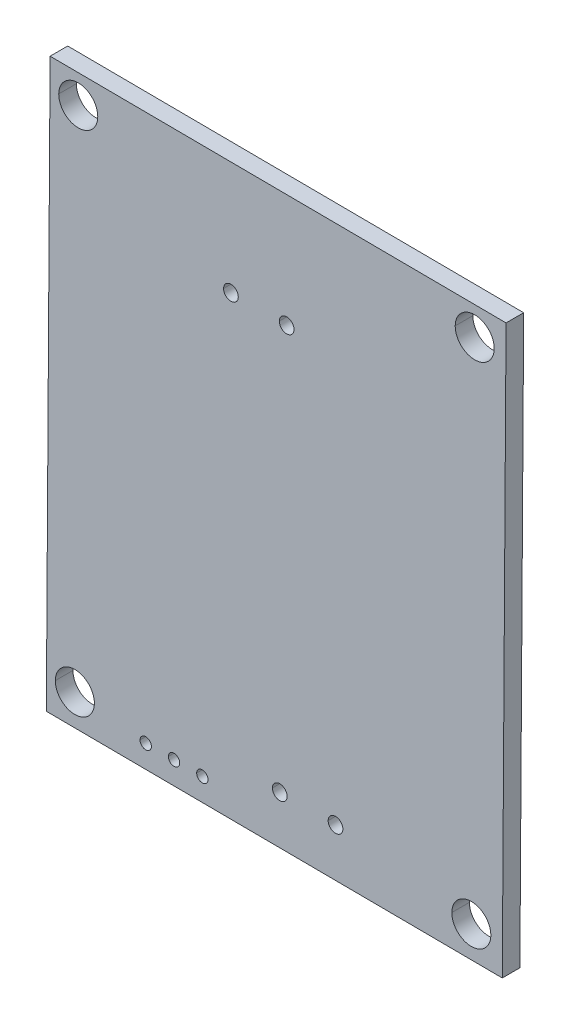
ISO-10303-21;
HEADER;
FILE_DESCRIPTION(('STEP AP214'),'2;1');
FILE_NAME('part.step','',(''),(''),'','','');
FILE_SCHEMA(('AUTOMOTIVE_DESIGN { 1 0 10303 214 1 1 1 1 }'));
ENDSEC;
DATA;
#1=APPLICATION_CONTEXT('core data for automotive mechanical design processes');
#2=APPLICATION_PROTOCOL_DEFINITION('international standard','automotive_design',2000,#1);
#3=PRODUCT_CONTEXT('',#1,'mechanical');
#4=PRODUCT('Part','Part','',(#3));
#5=PRODUCT_RELATED_PRODUCT_CATEGORY('part','',(#4));
#6=PRODUCT_DEFINITION_FORMATION('','',#4);
#7=PRODUCT_DEFINITION_CONTEXT('part definition',#1,'design');
#8=PRODUCT_DEFINITION('design','',#6,#7);
#9=PRODUCT_DEFINITION_SHAPE('','',#8);
#10=(LENGTH_UNIT() NAMED_UNIT(*) SI_UNIT(.MILLI.,.METRE.));
#11=(NAMED_UNIT(*) PLANE_ANGLE_UNIT() SI_UNIT($,.RADIAN.));
#12=(NAMED_UNIT(*) SI_UNIT($,.STERADIAN.) SOLID_ANGLE_UNIT());
#13=UNCERTAINTY_MEASURE_WITH_UNIT(LENGTH_MEASURE(1.E-05),#10,'distance_accuracy_value','');
#14=(GEOMETRIC_REPRESENTATION_CONTEXT(3) GLOBAL_UNCERTAINTY_ASSIGNED_CONTEXT((#13)) GLOBAL_UNIT_ASSIGNED_CONTEXT((#10,
#11,#12)) REPRESENTATION_CONTEXT('',''));
#15=CARTESIAN_POINT('',(0.,0.,0.));
#16=DIRECTION('',(0.,0.,1.));
#17=DIRECTION('',(1.,0.,0.));
#18=AXIS2_PLACEMENT_3D('',#15,#16,#17);
#19=CARTESIAN_POINT('',(220.01480723588,82.6072608987115,139.791582908599));
#20=DIRECTION('',(0.,0.,1.));
#21=DIRECTION('',(0.999978016708569,-0.00663069374924009,0.));
#22=AXIS2_PLACEMENT_3D('',#19,#20,#21);
#23=CYLINDRICAL_SURFACE('',#22,1.75);
#24=CARTESIAN_POINT('',(220.01480723588,82.6072608987115,140.581582908599));
#25=DIRECTION('',(0.,0.,1.));
#26=DIRECTION('',(0.999978016708569,-0.00663069374924009,0.));
#27=AXIS2_PLACEMENT_3D('',#24,#25,#26);
#28=CIRCLE('',#27,1.75);
#29=CARTESIAN_POINT('',(218.26484570664,82.6188646127726,140.581582908599));
#30=VERTEX_POINT('',#29);
#31=CARTESIAN_POINT('',(221.764768765119,82.5956571846503,140.581582908599));
#32=VERTEX_POINT('',#31);
#33=EDGE_CURVE('E67',#30,#32,#28,.T.);
#34=ORIENTED_EDGE('',*,*,#33,.F.);
#35=DIRECTION('',(0.,0.,1.));
#36=VECTOR('',#35,1.);
#37=CARTESIAN_POINT('',(218.26484570664,82.6188646127726,139.791582908599));
#38=LINE('',#37,#36);
#39=CARTESIAN_POINT('',(218.26484570664,82.6188646127726,142.161582908599));
#40=VERTEX_POINT('',#39);
#41=EDGE_CURVE('E11',#30,#40,#38,.T.);
#42=ORIENTED_EDGE('',*,*,#41,.T.);
#43=CARTESIAN_POINT('',(220.01480723588,82.6072608987115,142.161582908599));
#44=DIRECTION('',(0.,0.,1.));
#45=DIRECTION('',(0.999978016708569,-0.00663069374924009,0.));
#46=AXIS2_PLACEMENT_3D('',#43,#44,#45);
#47=CIRCLE('',#46,1.75);
#48=CARTESIAN_POINT('',(221.764768765119,82.5956571846503,142.161582908599));
#49=VERTEX_POINT('',#48);
#50=EDGE_CURVE('E55',#40,#49,#47,.T.);
#51=ORIENTED_EDGE('',*,*,#50,.T.);
#52=DIRECTION('',(0.,0.,1.));
#53=VECTOR('',#52,1.);
#54=CARTESIAN_POINT('',(221.764768765119,82.5956571846503,139.791582908599));
#55=LINE('',#54,#53);
#56=EDGE_CURVE('E366',#32,#49,#55,.T.);
#57=ORIENTED_EDGE('',*,*,#56,.F.);
#58=EDGE_LOOP('',(#34,#42,#51,#57));
#59=FACE_BOUND('',#58,.T.);
#60=ADVANCED_FACE('F44',(#59),#23,.F.);
#61=CARTESIAN_POINT('',(207.833180433443,84.212068814366,139.791582908599));
#62=DIRECTION('',(0.,0.,1.));
#63=DIRECTION('',(0.999978016708569,-0.0066306937492422,0.));
#64=AXIS2_PLACEMENT_3D('',#61,#62,#63);
#65=CYLINDRICAL_SURFACE('',#64,0.660000000000009);
#66=CARTESIAN_POINT('',(207.833180433443,84.212068814366,140.581582908599));
#67=DIRECTION('',(0.,0.,1.));
#68=DIRECTION('',(0.999978016708569,-0.0066306937492422,0.));
#69=AXIS2_PLACEMENT_3D('',#66,#67,#68);
#70=CIRCLE('',#69,0.660000000000009);
#71=CARTESIAN_POINT('',(207.173194942415,84.2164450722405,140.581582908599));
#72=VERTEX_POINT('',#71);
#73=CARTESIAN_POINT('',(208.49316592447,84.2076925564915,140.581582908599));
#74=VERTEX_POINT('',#73);
#75=EDGE_CURVE('E239',#72,#74,#70,.T.);
#76=ORIENTED_EDGE('',*,*,#75,.F.);
#77=DIRECTION('',(0.,0.,1.));
#78=VECTOR('',#77,1.);
#79=CARTESIAN_POINT('',(207.173194942415,84.2164450722405,139.791582908599));
#80=LINE('',#79,#78);
#81=CARTESIAN_POINT('',(207.173194942415,84.2164450722405,142.161582908599));
#82=VERTEX_POINT('',#81);
#83=EDGE_CURVE('E240',#72,#82,#80,.T.);
#84=ORIENTED_EDGE('',*,*,#83,.T.);
#85=CARTESIAN_POINT('',(207.833180433443,84.212068814366,142.161582908599));
#86=DIRECTION('',(0.,0.,1.));
#87=DIRECTION('',(0.999978016708569,-0.0066306937492422,0.));
#88=AXIS2_PLACEMENT_3D('',#85,#86,#87);
#89=CIRCLE('',#88,0.660000000000009);
#90=CARTESIAN_POINT('',(208.49316592447,84.2076925564915,142.161582908599));
#91=VERTEX_POINT('',#90);
#92=EDGE_CURVE('E244',#82,#91,#89,.T.);
#93=ORIENTED_EDGE('',*,*,#92,.T.);
#94=DIRECTION('',(0.,0.,1.));
#95=VECTOR('',#94,1.);
#96=CARTESIAN_POINT('',(208.49316592447,84.2076925564915,139.791582908599));
#97=LINE('',#96,#95);
#98=EDGE_CURVE('E437',#74,#91,#97,.T.);
#99=ORIENTED_EDGE('',*,*,#98,.F.);
#100=EDGE_LOOP('',(#76,#84,#93,#99));
#101=FACE_BOUND('',#100,.T.);
#102=ADVANCED_FACE('F624',(#101),#65,.F.);
#103=CARTESIAN_POINT('',(202.833290349899,84.2452222831122,139.791582908599));
#104=DIRECTION('',(0.,0.,1.));
#105=DIRECTION('',(0.999978016708569,-0.0066306937492422,0.));
#106=AXIS2_PLACEMENT_3D('',#103,#104,#105);
#107=CYLINDRICAL_SURFACE('',#106,0.660000000000009);
#108=CARTESIAN_POINT('',(202.833290349899,84.2452222831122,140.581582908599));
#109=DIRECTION('',(0.,0.,1.));
#110=DIRECTION('',(0.999978016708569,-0.0066306937492422,0.));
#111=AXIS2_PLACEMENT_3D('',#108,#109,#110);
#112=CIRCLE('',#111,0.660000000000009);
#113=CARTESIAN_POINT('',(202.173304858872,84.2495985409867,140.581582908599));
#114=VERTEX_POINT('',#113);
#115=CARTESIAN_POINT('',(203.493275840928,84.2408460252377,140.581582908599));
#116=VERTEX_POINT('',#115);
#117=EDGE_CURVE('E238',#114,#116,#112,.T.);
#118=ORIENTED_EDGE('',*,*,#117,.F.);
#119=DIRECTION('',(0.,0.,1.));
#120=VECTOR('',#119,1.);
#121=CARTESIAN_POINT('',(202.173304858872,84.2495985409867,139.791582908599));
#122=LINE('',#121,#120);
#123=CARTESIAN_POINT('',(202.173304858872,84.2495985409867,142.161582908599));
#124=VERTEX_POINT('',#123);
#125=EDGE_CURVE('E308',#114,#124,#122,.T.);
#126=ORIENTED_EDGE('',*,*,#125,.T.);
#127=CARTESIAN_POINT('',(202.833290349899,84.2452222831122,142.161582908599));
#128=DIRECTION('',(0.,0.,1.));
#129=DIRECTION('',(0.999978016708569,-0.0066306937492422,0.));
#130=AXIS2_PLACEMENT_3D('',#127,#128,#129);
#131=CIRCLE('',#130,0.660000000000009);
#132=CARTESIAN_POINT('',(203.493275840928,84.2408460252377,142.161582908599));
#133=VERTEX_POINT('',#132);
#134=EDGE_CURVE('E339',#124,#133,#131,.T.);
#135=ORIENTED_EDGE('',*,*,#134,.T.);
#136=DIRECTION('',(0.,0.,1.));
#137=VECTOR('',#136,1.);
#138=CARTESIAN_POINT('',(203.493275840928,84.2408460252377,139.791582908599));
#139=LINE('',#138,#137);
#140=EDGE_CURVE('E280',#116,#133,#139,.T.);
#141=ORIENTED_EDGE('',*,*,#140,.F.);
#142=EDGE_LOOP('',(#118,#126,#135,#141));
#143=FACE_BOUND('',#142,.T.);
#144=ADVANCED_FACE('F629',(#143),#107,.F.);
#145=CARTESIAN_POINT('',(195.890284884232,82.0052099832111,139.791582908599));
#146=DIRECTION('',(0.,0.,1.));
#147=DIRECTION('',(0.999978016708569,-0.00663069374923974,0.));
#148=AXIS2_PLACEMENT_3D('',#145,#146,#147);
#149=CYLINDRICAL_SURFACE('',#148,0.510000000000006);
#150=CARTESIAN_POINT('',(195.890284884232,82.0052099832111,140.581582908599));
#151=DIRECTION('',(0.,0.,1.));
#152=DIRECTION('',(0.999978016708569,-0.00663069374923974,0.));
#153=AXIS2_PLACEMENT_3D('',#150,#151,#152);
#154=CIRCLE('',#153,0.510000000000006);
#155=CARTESIAN_POINT('',(195.38029609571,82.0085916370232,140.581582908599));
#156=VERTEX_POINT('',#155);
#157=CARTESIAN_POINT('',(196.400273672753,82.001828329399,140.581582908599));
#158=VERTEX_POINT('',#157);
#159=EDGE_CURVE('E48',#156,#158,#154,.T.);
#160=ORIENTED_EDGE('',*,*,#159,.F.);
#161=DIRECTION('',(0.,0.,1.));
#162=VECTOR('',#161,1.);
#163=CARTESIAN_POINT('',(195.38029609571,82.0085916370232,139.791582908599));
#164=LINE('',#163,#162);
#165=CARTESIAN_POINT('',(195.38029609571,82.0085916370232,142.161582908599));
#166=VERTEX_POINT('',#165);
#167=EDGE_CURVE('E402',#156,#166,#164,.T.);
#168=ORIENTED_EDGE('',*,*,#167,.T.);
#169=CARTESIAN_POINT('',(195.890284884232,82.0052099832111,142.161582908599));
#170=DIRECTION('',(0.,0.,1.));
#171=DIRECTION('',(0.999978016708569,-0.00663069374923974,0.));
#172=AXIS2_PLACEMENT_3D('',#169,#170,#171);
#173=CIRCLE('',#172,0.510000000000006);
#174=CARTESIAN_POINT('',(196.400273672753,82.001828329399,142.161582908599));
#175=VERTEX_POINT('',#174);
#176=EDGE_CURVE('E448',#166,#175,#173,.T.);
#177=ORIENTED_EDGE('',*,*,#176,.T.);
#178=DIRECTION('',(0.,0.,1.));
#179=VECTOR('',#178,1.);
#180=CARTESIAN_POINT('',(196.400273672753,82.001828329399,139.791582908599));
#181=LINE('',#180,#179);
#182=EDGE_CURVE('E433',#158,#175,#181,.T.);
#183=ORIENTED_EDGE('',*,*,#182,.F.);
#184=EDGE_LOOP('',(#160,#168,#177,#183));
#185=FACE_BOUND('',#184,.T.);
#186=ADVANCED_FACE('F584',(#185),#149,.F.);
#187=CARTESIAN_POINT('',(193.350340721792,82.0220519453342,139.791582908599));
#188=DIRECTION('',(0.,0.,1.));
#189=DIRECTION('',(0.999978016708569,-0.00663069374923974,0.));
#190=AXIS2_PLACEMENT_3D('',#187,#188,#189);
#191=CYLINDRICAL_SURFACE('',#190,0.510000000000006);
#192=CARTESIAN_POINT('',(193.350340721792,82.0220519453342,140.581582908599));
#193=DIRECTION('',(0.,0.,1.));
#194=DIRECTION('',(0.999978016708569,-0.00663069374923974,0.));
#195=AXIS2_PLACEMENT_3D('',#192,#193,#194);
#196=CIRCLE('',#195,0.510000000000006);
#197=CARTESIAN_POINT('',(192.840351933271,82.0254335991463,140.581582908599));
#198=VERTEX_POINT('',#197);
#199=CARTESIAN_POINT('',(193.860329510314,82.018670291522,140.581582908599));
#200=VERTEX_POINT('',#199);
#201=EDGE_CURVE('E295',#198,#200,#196,.T.);
#202=ORIENTED_EDGE('',*,*,#201,.F.);
#203=DIRECTION('',(0.,0.,1.));
#204=VECTOR('',#203,1.);
#205=CARTESIAN_POINT('',(192.840351933271,82.0254335991463,139.791582908599));
#206=LINE('',#205,#204);
#207=CARTESIAN_POINT('',(192.840351933271,82.0254335991463,142.161582908599));
#208=VERTEX_POINT('',#207);
#209=EDGE_CURVE('E444',#198,#208,#206,.T.);
#210=ORIENTED_EDGE('',*,*,#209,.T.);
#211=CARTESIAN_POINT('',(193.350340721792,82.0220519453342,142.161582908599));
#212=DIRECTION('',(0.,0.,1.));
#213=DIRECTION('',(0.999978016708569,-0.00663069374923974,0.));
#214=AXIS2_PLACEMENT_3D('',#211,#212,#213);
#215=CIRCLE('',#214,0.510000000000006);
#216=CARTESIAN_POINT('',(193.860329510314,82.018670291522,142.161582908599));
#217=VERTEX_POINT('',#216);
#218=EDGE_CURVE('E269',#208,#217,#215,.T.);
#219=ORIENTED_EDGE('',*,*,#218,.T.);
#220=DIRECTION('',(0.,0.,1.));
#221=VECTOR('',#220,1.);
#222=CARTESIAN_POINT('',(193.860329510314,82.018670291522,139.791582908599));
#223=LINE('',#222,#221);
#224=EDGE_CURVE('E221',#200,#217,#223,.T.);
#225=ORIENTED_EDGE('',*,*,#224,.F.);
#226=EDGE_LOOP('',(#202,#210,#219,#225));
#227=FACE_BOUND('',#226,.T.);
#228=ADVANCED_FACE('F666',(#227),#191,.F.);
#229=CARTESIAN_POINT('',(190.810396559353,82.0388939074572,139.791582908599));
#230=DIRECTION('',(0.,0.,1.));
#231=DIRECTION('',(0.999978016708569,-0.00663069374923974,0.));
#232=AXIS2_PLACEMENT_3D('',#229,#230,#231);
#233=CYLINDRICAL_SURFACE('',#232,0.510000000000006);
#234=CARTESIAN_POINT('',(190.810396559353,82.0388939074572,140.581582908599));
#235=DIRECTION('',(0.,0.,1.));
#236=DIRECTION('',(0.999978016708569,-0.00663069374923974,0.));
#237=AXIS2_PLACEMENT_3D('',#234,#235,#236);
#238=CIRCLE('',#237,0.510000000000006);
#239=CARTESIAN_POINT('',(190.300407770831,82.0422755612694,140.581582908599));
#240=VERTEX_POINT('',#239);
#241=CARTESIAN_POINT('',(191.320385347874,82.0355122536451,140.581582908599));
#242=VERTEX_POINT('',#241);
#243=EDGE_CURVE('E245',#240,#242,#238,.T.);
#244=ORIENTED_EDGE('',*,*,#243,.F.);
#245=DIRECTION('',(0.,0.,1.));
#246=VECTOR('',#245,1.);
#247=CARTESIAN_POINT('',(190.300407770831,82.0422755612694,139.791582908599));
#248=LINE('',#247,#246);
#249=CARTESIAN_POINT('',(190.300407770831,82.0422755612694,142.161582908599));
#250=VERTEX_POINT('',#249);
#251=EDGE_CURVE('E265',#240,#250,#248,.T.);
#252=ORIENTED_EDGE('',*,*,#251,.T.);
#253=CARTESIAN_POINT('',(190.810396559353,82.0388939074572,142.161582908599));
#254=DIRECTION('',(0.,0.,1.));
#255=DIRECTION('',(0.999978016708569,-0.00663069374923974,0.));
#256=AXIS2_PLACEMENT_3D('',#253,#254,#255);
#257=CIRCLE('',#256,0.510000000000006);
#258=CARTESIAN_POINT('',(191.320385347874,82.0355122536451,142.161582908599));
#259=VERTEX_POINT('',#258);
#260=EDGE_CURVE('E270',#250,#259,#257,.T.);
#261=ORIENTED_EDGE('',*,*,#260,.T.);
#262=DIRECTION('',(0.,0.,1.));
#263=VECTOR('',#262,1.);
#264=CARTESIAN_POINT('',(191.320385347874,82.0355122536451,139.791582908599));
#265=LINE('',#264,#263);
#266=EDGE_CURVE('E261',#242,#259,#265,.T.);
#267=ORIENTED_EDGE('',*,*,#266,.F.);
#268=EDGE_LOOP('',(#244,#252,#261,#267));
#269=FACE_BOUND('',#268,.T.);
#270=ADVANCED_FACE('F689',(#269),#233,.F.);
#271=CARTESIAN_POINT('',(184.455588961722,82.8430483684343,139.791582908599));
#272=DIRECTION('',(0.,0.,1.));
#273=DIRECTION('',(0.999978016708569,-0.00663069374924009,0.));
#274=AXIS2_PLACEMENT_3D('',#271,#272,#273);
#275=CYLINDRICAL_SURFACE('',#274,1.75);
#276=CARTESIAN_POINT('',(184.455588961722,82.8430483684343,140.581582908599));
#277=DIRECTION('',(0.,0.,1.));
#278=DIRECTION('',(0.999978016708569,-0.00663069374924009,0.));
#279=AXIS2_PLACEMENT_3D('',#276,#277,#278);
#280=CIRCLE('',#279,1.75);
#281=CARTESIAN_POINT('',(182.705627432482,82.8546520824955,140.581582908599));
#282=VERTEX_POINT('',#281);
#283=CARTESIAN_POINT('',(186.205550490963,82.8314446543731,140.581582908599));
#284=VERTEX_POINT('',#283);
#285=EDGE_CURVE('E227',#282,#284,#280,.T.);
#286=ORIENTED_EDGE('',*,*,#285,.F.);
#287=DIRECTION('',(0.,0.,1.));
#288=VECTOR('',#287,1.);
#289=CARTESIAN_POINT('',(182.705627432482,82.8546520824955,139.791582908599));
#290=LINE('',#289,#288);
#291=CARTESIAN_POINT('',(182.705627432482,82.8546520824955,142.161582908599));
#292=VERTEX_POINT('',#291);
#293=EDGE_CURVE('E289',#282,#292,#290,.T.);
#294=ORIENTED_EDGE('',*,*,#293,.T.);
#295=CARTESIAN_POINT('',(184.455588961722,82.8430483684343,142.161582908599));
#296=DIRECTION('',(0.,0.,1.));
#297=DIRECTION('',(0.999978016708569,-0.00663069374924009,0.));
#298=AXIS2_PLACEMENT_3D('',#295,#296,#297);
#299=CIRCLE('',#298,1.75);
#300=CARTESIAN_POINT('',(186.205550490963,82.8314446543731,142.161582908599));
#301=VERTEX_POINT('',#300);
#302=EDGE_CURVE('E286',#292,#301,#299,.T.);
#303=ORIENTED_EDGE('',*,*,#302,.T.);
#304=DIRECTION('',(0.,0.,1.));
#305=VECTOR('',#304,1.);
#306=CARTESIAN_POINT('',(186.205550490963,82.8314446543731,139.791582908599));
#307=LINE('',#306,#305);
#308=EDGE_CURVE('E326',#284,#301,#307,.T.);
#309=ORIENTED_EDGE('',*,*,#308,.F.);
#310=EDGE_LOOP('',(#286,#294,#303,#309));
#311=FACE_BOUND('',#310,.T.);
#312=ADVANCED_FACE('F46',(#311),#275,.F.);
#313=CARTESIAN_POINT('',(220.317962554094,128.326255822627,139.791582908599));
#314=DIRECTION('',(0.,0.,1.));
#315=DIRECTION('',(0.999978016708569,-0.00663069374924009,0.));
#316=AXIS2_PLACEMENT_3D('',#313,#314,#315);
#317=CYLINDRICAL_SURFACE('',#316,1.75);
#318=CARTESIAN_POINT('',(220.317962554094,128.326255822627,140.581582908599));
#319=DIRECTION('',(0.,0.,1.));
#320=DIRECTION('',(0.999978016708569,-0.00663069374924009,0.));
#321=AXIS2_PLACEMENT_3D('',#318,#319,#320);
#322=CIRCLE('',#321,1.75);
#323=CARTESIAN_POINT('',(218.568001024855,128.337859536688,140.581582908599));
#324=VERTEX_POINT('',#323);
#325=CARTESIAN_POINT('',(222.067924083335,128.314652108566,140.581582908599));
#326=VERTEX_POINT('',#325);
#327=EDGE_CURVE('E226',#324,#326,#322,.T.);
#328=ORIENTED_EDGE('',*,*,#327,.F.);
#329=DIRECTION('',(0.,0.,1.));
#330=VECTOR('',#329,1.);
#331=CARTESIAN_POINT('',(218.568001024855,128.337859536688,139.791582908599));
#332=LINE('',#331,#330);
#333=CARTESIAN_POINT('',(218.568001024855,128.337859536688,142.161582908599));
#334=VERTEX_POINT('',#333);
#335=EDGE_CURVE('E290',#324,#334,#332,.T.);
#336=ORIENTED_EDGE('',*,*,#335,.T.);
#337=CARTESIAN_POINT('',(220.317962554094,128.326255822627,142.161582908599));
#338=DIRECTION('',(0.,0.,1.));
#339=DIRECTION('',(0.999978016708569,-0.00663069374924009,0.));
#340=AXIS2_PLACEMENT_3D('',#337,#338,#339);
#341=CIRCLE('',#340,1.75);
#342=CARTESIAN_POINT('',(222.067924083335,128.314652108566,142.161582908599));
#343=VERTEX_POINT('',#342);
#344=EDGE_CURVE('E398',#334,#343,#341,.T.);
#345=ORIENTED_EDGE('',*,*,#344,.T.);
#346=DIRECTION('',(0.,0.,1.));
#347=VECTOR('',#346,1.);
#348=CARTESIAN_POINT('',(222.067924083335,128.314652108566,139.791582908599));
#349=LINE('',#348,#347);
#350=EDGE_CURVE('E264',#326,#343,#349,.T.);
#351=ORIENTED_EDGE('',*,*,#350,.F.);
#352=EDGE_LOOP('',(#328,#336,#345,#351));
#353=FACE_BOUND('',#352,.T.);
#354=ADVANCED_FACE('F637',(#353),#317,.F.);
#355=CARTESIAN_POINT('',(203.452806316771,120.817918450701,139.791582908599));
#356=DIRECTION('',(0.,0.,1.));
#357=DIRECTION('',(0.999978016708569,-0.0066306937492422,0.));
#358=AXIS2_PLACEMENT_3D('',#355,#356,#357);
#359=CYLINDRICAL_SURFACE('',#358,0.660000000000009);
#360=CARTESIAN_POINT('',(203.452806316771,120.817918450701,140.581582908599));
#361=DIRECTION('',(0.,0.,1.));
#362=DIRECTION('',(0.999978016708569,-0.0066306937492422,0.));
#363=AXIS2_PLACEMENT_3D('',#360,#361,#362);
#364=CIRCLE('',#363,0.660000000000009);
#365=CARTESIAN_POINT('',(202.792820825743,120.822294708576,140.581582908599));
#366=VERTEX_POINT('',#365);
#367=CARTESIAN_POINT('',(204.112791807799,120.813542192827,140.581582908599));
#368=VERTEX_POINT('',#367);
#369=EDGE_CURVE('E184',#366,#368,#364,.T.);
#370=ORIENTED_EDGE('',*,*,#369,.F.);
#371=DIRECTION('',(0.,0.,1.));
#372=VECTOR('',#371,1.);
#373=CARTESIAN_POINT('',(202.792820825743,120.822294708576,139.791582908599));
#374=LINE('',#373,#372);
#375=CARTESIAN_POINT('',(202.792820825743,120.822294708576,142.161582908599));
#376=VERTEX_POINT('',#375);
#377=EDGE_CURVE('E209',#366,#376,#374,.T.);
#378=ORIENTED_EDGE('',*,*,#377,.T.);
#379=CARTESIAN_POINT('',(203.452806316771,120.817918450701,142.161582908599));
#380=DIRECTION('',(0.,0.,1.));
#381=DIRECTION('',(0.999978016708569,-0.0066306937492422,0.));
#382=AXIS2_PLACEMENT_3D('',#379,#380,#381);
#383=CIRCLE('',#382,0.660000000000009);
#384=CARTESIAN_POINT('',(204.112791807799,120.813542192827,142.161582908599));
#385=VERTEX_POINT('',#384);
#386=EDGE_CURVE('E200',#376,#385,#383,.T.);
#387=ORIENTED_EDGE('',*,*,#386,.T.);
#388=DIRECTION('',(0.,0.,1.));
#389=VECTOR('',#388,1.);
#390=CARTESIAN_POINT('',(204.112791807799,120.813542192827,139.791582908599));
#391=LINE('',#390,#389);
#392=EDGE_CURVE('E197',#368,#385,#391,.T.);
#393=ORIENTED_EDGE('',*,*,#392,.F.);
#394=EDGE_LOOP('',(#370,#378,#387,#393));
#395=FACE_BOUND('',#394,.T.);
#396=ADVANCED_FACE('F198',(#395),#359,.F.);
#397=CARTESIAN_POINT('',(198.452916233228,120.851071919447,139.791582908599));
#398=DIRECTION('',(0.,0.,1.));
#399=DIRECTION('',(0.999978016708569,-0.0066306937492422,0.));
#400=AXIS2_PLACEMENT_3D('',#397,#398,#399);
#401=CYLINDRICAL_SURFACE('',#400,0.660000000000009);
#402=CARTESIAN_POINT('',(198.452916233228,120.851071919447,140.581582908599));
#403=DIRECTION('',(0.,0.,1.));
#404=DIRECTION('',(0.999978016708569,-0.0066306937492422,0.));
#405=AXIS2_PLACEMENT_3D('',#402,#403,#404);
#406=CIRCLE('',#405,0.660000000000009);
#407=CARTESIAN_POINT('',(197.7929307422,120.855448177322,140.581582908599));
#408=VERTEX_POINT('',#407);
#409=CARTESIAN_POINT('',(199.112901724255,120.846695661573,140.581582908599));
#410=VERTEX_POINT('',#409);
#411=EDGE_CURVE('E211',#408,#410,#406,.T.);
#412=ORIENTED_EDGE('',*,*,#411,.F.);
#413=DIRECTION('',(0.,0.,1.));
#414=VECTOR('',#413,1.);
#415=CARTESIAN_POINT('',(197.7929307422,120.855448177322,139.791582908599));
#416=LINE('',#415,#414);
#417=CARTESIAN_POINT('',(197.7929307422,120.855448177322,142.161582908599));
#418=VERTEX_POINT('',#417);
#419=EDGE_CURVE('E335',#408,#418,#416,.T.);
#420=ORIENTED_EDGE('',*,*,#419,.T.);
#421=CARTESIAN_POINT('',(198.452916233228,120.851071919447,142.161582908599));
#422=DIRECTION('',(0.,0.,1.));
#423=DIRECTION('',(0.999978016708569,-0.0066306937492422,0.));
#424=AXIS2_PLACEMENT_3D('',#421,#422,#423);
#425=CIRCLE('',#424,0.660000000000009);
#426=CARTESIAN_POINT('',(199.112901724255,120.846695661573,142.161582908599));
#427=VERTEX_POINT('',#426);
#428=EDGE_CURVE('E370',#418,#427,#425,.T.);
#429=ORIENTED_EDGE('',*,*,#428,.T.);
#430=DIRECTION('',(0.,0.,1.));
#431=VECTOR('',#430,1.);
#432=CARTESIAN_POINT('',(199.112901724255,120.846695661573,139.791582908599));
#433=LINE('',#432,#431);
#434=EDGE_CURVE('E256',#410,#427,#433,.T.);
#435=ORIENTED_EDGE('',*,*,#434,.F.);
#436=EDGE_LOOP('',(#412,#420,#429,#435));
#437=FACE_BOUND('',#436,.T.);
#438=ADVANCED_FACE('F636',(#437),#401,.F.);
#439=CARTESIAN_POINT('',(184.758744279938,128.56204329235,139.791582908599));
#440=DIRECTION('',(0.,0.,1.));
#441=DIRECTION('',(0.999978016708569,-0.00663069374924009,0.));
#442=AXIS2_PLACEMENT_3D('',#439,#440,#441);
#443=CYLINDRICAL_SURFACE('',#442,1.75);
#444=CARTESIAN_POINT('',(184.758744279938,128.56204329235,140.581582908599));
#445=DIRECTION('',(0.,0.,1.));
#446=DIRECTION('',(0.999978016708569,-0.00663069374924009,0.));
#447=AXIS2_PLACEMENT_3D('',#444,#445,#446);
#448=CIRCLE('',#447,1.75);
#449=CARTESIAN_POINT('',(183.008782750698,128.573647006411,140.581582908599));
#450=VERTEX_POINT('',#449);
#451=CARTESIAN_POINT('',(186.508705809178,128.550439578289,140.581582908599));
#452=VERTEX_POINT('',#451);
#453=EDGE_CURVE('E319',#450,#452,#448,.T.);
#454=ORIENTED_EDGE('',*,*,#453,.F.);
#455=DIRECTION('',(0.,0.,1.));
#456=VECTOR('',#455,1.);
#457=CARTESIAN_POINT('',(183.008782750698,128.573647006411,139.791582908599));
#458=LINE('',#457,#456);
#459=CARTESIAN_POINT('',(183.008782750698,128.573647006411,142.161582908599));
#460=VERTEX_POINT('',#459);
#461=EDGE_CURVE('E304',#450,#460,#458,.T.);
#462=ORIENTED_EDGE('',*,*,#461,.T.);
#463=CARTESIAN_POINT('',(184.758744279938,128.56204329235,142.161582908599));
#464=DIRECTION('',(0.,0.,1.));
#465=DIRECTION('',(0.999978016708569,-0.00663069374924009,0.));
#466=AXIS2_PLACEMENT_3D('',#463,#464,#465);
#467=CIRCLE('',#466,1.75);
#468=CARTESIAN_POINT('',(186.508705809178,128.550439578289,142.161582908599));
#469=VERTEX_POINT('',#468);
#470=EDGE_CURVE('E300',#460,#469,#467,.T.);
#471=ORIENTED_EDGE('',*,*,#470,.T.);
#472=DIRECTION('',(0.,0.,1.));
#473=VECTOR('',#472,1.);
#474=CARTESIAN_POINT('',(186.508705809178,128.550439578289,139.791582908599));
#475=LINE('',#474,#473);
#476=EDGE_CURVE('E255',#452,#469,#475,.T.);
#477=ORIENTED_EDGE('',*,*,#476,.F.);
#478=EDGE_LOOP('',(#454,#462,#471,#477));
#479=FACE_BOUND('',#478,.T.);
#480=ADVANCED_FACE('F735',(#479),#443,.F.);
#481=CARTESIAN_POINT('',(184.758744279938,128.56204329235,139.791582908599));
#482=DIRECTION('',(0.,0.,1.));
#483=DIRECTION('',(0.999978016708569,-0.00663069374924009,0.));
#484=AXIS2_PLACEMENT_3D('',#481,#482,#483);
#485=CYLINDRICAL_SURFACE('',#484,1.75);
#486=ORIENTED_EDGE('',*,*,#461,.F.);
#487=CARTESIAN_POINT('',(184.758744279938,128.56204329235,140.581582908599));
#488=DIRECTION('',(0.,0.,1.));
#489=DIRECTION('',(0.999978016708569,-0.00663069374924009,0.));
#490=AXIS2_PLACEMENT_3D('',#487,#488,#489);
#491=CIRCLE('',#490,1.75);
#492=EDGE_CURVE('E422',#452,#450,#491,.T.);
#493=ORIENTED_EDGE('',*,*,#492,.F.);
#494=ORIENTED_EDGE('',*,*,#476,.T.);
#495=CARTESIAN_POINT('',(184.758744279938,128.56204329235,142.161582908599));
#496=DIRECTION('',(0.,0.,1.));
#497=DIRECTION('',(0.999978016708569,-0.00663069374924009,0.));
#498=AXIS2_PLACEMENT_3D('',#495,#496,#497);
#499=CIRCLE('',#498,1.75);
#500=EDGE_CURVE('E251',#469,#460,#499,.T.);
#501=ORIENTED_EDGE('',*,*,#500,.T.);
#502=EDGE_LOOP('',(#486,#493,#494,#501));
#503=FACE_BOUND('',#502,.T.);
#504=ADVANCED_FACE('F676',(#503),#485,.F.);
#505=CARTESIAN_POINT('',(198.452916233228,120.851071919447,139.791582908599));
#506=DIRECTION('',(0.,0.,1.));
#507=DIRECTION('',(0.999978016708569,-0.0066306937492422,0.));
#508=AXIS2_PLACEMENT_3D('',#505,#506,#507);
#509=CYLINDRICAL_SURFACE('',#508,0.660000000000009);
#510=ORIENTED_EDGE('',*,*,#419,.F.);
#511=CARTESIAN_POINT('',(198.452916233228,120.851071919447,140.581582908599));
#512=DIRECTION('',(0.,0.,1.));
#513=DIRECTION('',(0.999978016708569,-0.0066306937492422,0.));
#514=AXIS2_PLACEMENT_3D('',#511,#512,#513);
#515=CIRCLE('',#514,0.660000000000009);
#516=EDGE_CURVE('E217',#410,#408,#515,.T.);
#517=ORIENTED_EDGE('',*,*,#516,.F.);
#518=ORIENTED_EDGE('',*,*,#434,.T.);
#519=CARTESIAN_POINT('',(198.452916233228,120.851071919447,142.161582908599));
#520=DIRECTION('',(0.,0.,1.));
#521=DIRECTION('',(0.999978016708569,-0.0066306937492422,0.));
#522=AXIS2_PLACEMENT_3D('',#519,#520,#521);
#523=CIRCLE('',#522,0.660000000000009);
#524=EDGE_CURVE('E205',#427,#418,#523,.T.);
#525=ORIENTED_EDGE('',*,*,#524,.T.);
#526=EDGE_LOOP('',(#510,#517,#518,#525));
#527=FACE_BOUND('',#526,.T.);
#528=ADVANCED_FACE('F673',(#527),#509,.F.);
#529=CARTESIAN_POINT('',(203.452806316771,120.817918450701,139.791582908599));
#530=DIRECTION('',(0.,0.,1.));
#531=DIRECTION('',(0.999978016708569,-0.0066306937492422,0.));
#532=AXIS2_PLACEMENT_3D('',#529,#530,#531);
#533=CYLINDRICAL_SURFACE('',#532,0.660000000000009);
#534=ORIENTED_EDGE('',*,*,#377,.F.);
#535=CARTESIAN_POINT('',(203.452806316771,120.817918450701,140.581582908599));
#536=DIRECTION('',(0.,0.,1.));
#537=DIRECTION('',(0.999978016708569,-0.0066306937492422,0.));
#538=AXIS2_PLACEMENT_3D('',#535,#536,#537);
#539=CIRCLE('',#538,0.660000000000009);
#540=EDGE_CURVE('E189',#368,#366,#539,.T.);
#541=ORIENTED_EDGE('',*,*,#540,.F.);
#542=ORIENTED_EDGE('',*,*,#392,.T.);
#543=CARTESIAN_POINT('',(203.452806316771,120.817918450701,142.161582908599));
#544=DIRECTION('',(0.,0.,1.));
#545=DIRECTION('',(0.999978016708569,-0.0066306937492422,0.));
#546=AXIS2_PLACEMENT_3D('',#543,#544,#545);
#547=CIRCLE('',#546,0.660000000000009);
#548=EDGE_CURVE('E206',#385,#376,#547,.T.);
#549=ORIENTED_EDGE('',*,*,#548,.T.);
#550=EDGE_LOOP('',(#534,#541,#542,#549));
#551=FACE_BOUND('',#550,.T.);
#552=ADVANCED_FACE('F208',(#551),#533,.F.);
#553=CARTESIAN_POINT('',(220.317962554094,128.326255822627,139.791582908599));
#554=DIRECTION('',(0.,0.,1.));
#555=DIRECTION('',(0.999978016708569,-0.00663069374924009,0.));
#556=AXIS2_PLACEMENT_3D('',#553,#554,#555);
#557=CYLINDRICAL_SURFACE('',#556,1.75);
#558=ORIENTED_EDGE('',*,*,#335,.F.);
#559=CARTESIAN_POINT('',(220.317962554094,128.326255822627,140.581582908599));
#560=DIRECTION('',(0.,0.,1.));
#561=DIRECTION('',(0.999978016708569,-0.00663069374924009,0.));
#562=AXIS2_PLACEMENT_3D('',#559,#560,#561);
#563=CIRCLE('',#562,1.75);
#564=EDGE_CURVE('E194',#326,#324,#563,.T.);
#565=ORIENTED_EDGE('',*,*,#564,.F.);
#566=ORIENTED_EDGE('',*,*,#350,.T.);
#567=CARTESIAN_POINT('',(220.317962554094,128.326255822627,142.161582908599));
#568=DIRECTION('',(0.,0.,1.));
#569=DIRECTION('',(0.999978016708569,-0.00663069374924009,0.));
#570=AXIS2_PLACEMENT_3D('',#567,#568,#569);
#571=CIRCLE('',#570,1.75);
#572=EDGE_CURVE('E324',#343,#334,#571,.T.);
#573=ORIENTED_EDGE('',*,*,#572,.T.);
#574=EDGE_LOOP('',(#558,#565,#566,#573));
#575=FACE_BOUND('',#574,.T.);
#576=ADVANCED_FACE('F680',(#575),#557,.F.);
#577=CARTESIAN_POINT('',(184.455588961722,82.8430483684343,139.791582908599));
#578=DIRECTION('',(0.,0.,1.));
#579=DIRECTION('',(0.999978016708569,-0.00663069374924009,0.));
#580=AXIS2_PLACEMENT_3D('',#577,#578,#579);
#581=CYLINDRICAL_SURFACE('',#580,1.75);
#582=ORIENTED_EDGE('',*,*,#293,.F.);
#583=CARTESIAN_POINT('',(184.455588961722,82.8430483684343,140.581582908599));
#584=DIRECTION('',(0.,0.,1.));
#585=DIRECTION('',(0.999978016708569,-0.00663069374924009,0.));
#586=AXIS2_PLACEMENT_3D('',#583,#584,#585);
#587=CIRCLE('',#586,1.75);
#588=EDGE_CURVE('E223',#284,#282,#587,.T.);
#589=ORIENTED_EDGE('',*,*,#588,.F.);
#590=ORIENTED_EDGE('',*,*,#308,.T.);
#591=CARTESIAN_POINT('',(184.455588961722,82.8430483684343,142.161582908599));
#592=DIRECTION('',(0.,0.,1.));
#593=DIRECTION('',(0.999978016708569,-0.00663069374924009,0.));
#594=AXIS2_PLACEMENT_3D('',#591,#592,#593);
#595=CIRCLE('',#594,1.75);
#596=EDGE_CURVE('E315',#301,#292,#595,.T.);
#597=ORIENTED_EDGE('',*,*,#596,.T.);
#598=EDGE_LOOP('',(#582,#589,#590,#597));
#599=FACE_BOUND('',#598,.T.);
#600=ADVANCED_FACE('F678',(#599),#581,.F.);
#601=CARTESIAN_POINT('',(190.810396559353,82.0388939074572,139.791582908599));
#602=DIRECTION('',(0.,0.,1.));
#603=DIRECTION('',(0.999978016708569,-0.00663069374923974,0.));
#604=AXIS2_PLACEMENT_3D('',#601,#602,#603);
#605=CYLINDRICAL_SURFACE('',#604,0.510000000000006);
#606=ORIENTED_EDGE('',*,*,#251,.F.);
#607=CARTESIAN_POINT('',(190.810396559353,82.0388939074572,140.581582908599));
#608=DIRECTION('',(0.,0.,1.));
#609=DIRECTION('',(0.999978016708569,-0.00663069374923974,0.));
#610=AXIS2_PLACEMENT_3D('',#607,#608,#609);
#611=CIRCLE('',#610,0.510000000000006);
#612=EDGE_CURVE('E249',#242,#240,#611,.T.);
#613=ORIENTED_EDGE('',*,*,#612,.F.);
#614=ORIENTED_EDGE('',*,*,#266,.T.);
#615=CARTESIAN_POINT('',(190.810396559353,82.0388939074572,142.161582908599));
#616=DIRECTION('',(0.,0.,1.));
#617=DIRECTION('',(0.999978016708569,-0.00663069374923974,0.));
#618=AXIS2_PLACEMENT_3D('',#615,#616,#617);
#619=CIRCLE('',#618,0.510000000000006);
#620=EDGE_CURVE('E257',#259,#250,#619,.T.);
#621=ORIENTED_EDGE('',*,*,#620,.T.);
#622=EDGE_LOOP('',(#606,#613,#614,#621));
#623=FACE_BOUND('',#622,.T.);
#624=ADVANCED_FACE('F640',(#623),#605,.F.);
#625=CARTESIAN_POINT('',(193.350340721792,82.0220519453342,139.791582908599));
#626=DIRECTION('',(0.,0.,1.));
#627=DIRECTION('',(0.999978016708569,-0.00663069374923974,0.));
#628=AXIS2_PLACEMENT_3D('',#625,#626,#627);
#629=CYLINDRICAL_SURFACE('',#628,0.510000000000006);
#630=ORIENTED_EDGE('',*,*,#209,.F.);
#631=CARTESIAN_POINT('',(193.350340721792,82.0220519453342,140.581582908599));
#632=DIRECTION('',(0.,0.,1.));
#633=DIRECTION('',(0.999978016708569,-0.00663069374923974,0.));
#634=AXIS2_PLACEMENT_3D('',#631,#632,#633);
#635=CIRCLE('',#634,0.510000000000006);
#636=EDGE_CURVE('E250',#200,#198,#635,.T.);
#637=ORIENTED_EDGE('',*,*,#636,.F.);
#638=ORIENTED_EDGE('',*,*,#224,.T.);
#639=CARTESIAN_POINT('',(193.350340721792,82.0220519453342,142.161582908599));
#640=DIRECTION('',(0.,0.,1.));
#641=DIRECTION('',(0.999978016708569,-0.00663069374923974,0.));
#642=AXIS2_PLACEMENT_3D('',#639,#640,#641);
#643=CIRCLE('',#642,0.510000000000006);
#644=EDGE_CURVE('E429',#217,#208,#643,.T.);
#645=ORIENTED_EDGE('',*,*,#644,.T.);
#646=EDGE_LOOP('',(#630,#637,#638,#645));
#647=FACE_BOUND('',#646,.T.);
#648=ADVANCED_FACE('F638',(#647),#629,.F.);
#649=CARTESIAN_POINT('',(195.890284884232,82.0052099832111,139.791582908599));
#650=DIRECTION('',(0.,0.,1.));
#651=DIRECTION('',(0.999978016708569,-0.00663069374923974,0.));
#652=AXIS2_PLACEMENT_3D('',#649,#650,#651);
#653=CYLINDRICAL_SURFACE('',#652,0.510000000000006);
#654=ORIENTED_EDGE('',*,*,#167,.F.);
#655=CARTESIAN_POINT('',(195.890284884232,82.0052099832111,140.581582908599));
#656=DIRECTION('',(0.,0.,1.));
#657=DIRECTION('',(0.999978016708569,-0.00663069374923974,0.));
#658=AXIS2_PLACEMENT_3D('',#655,#656,#657);
#659=CIRCLE('',#658,0.510000000000006);
#660=EDGE_CURVE('E406',#158,#156,#659,.T.);
#661=ORIENTED_EDGE('',*,*,#660,.F.);
#662=ORIENTED_EDGE('',*,*,#182,.T.);
#663=CARTESIAN_POINT('',(195.890284884232,82.0052099832111,142.161582908599));
#664=DIRECTION('',(0.,0.,1.));
#665=DIRECTION('',(0.999978016708569,-0.00663069374923974,0.));
#666=AXIS2_PLACEMENT_3D('',#663,#664,#665);
#667=CIRCLE('',#666,0.510000000000006);
#668=EDGE_CURVE('E284',#175,#166,#667,.T.);
#669=ORIENTED_EDGE('',*,*,#668,.T.);
#670=EDGE_LOOP('',(#654,#661,#662,#669));
#671=FACE_BOUND('',#670,.T.);
#672=ADVANCED_FACE('F590',(#671),#653,.F.);
#673=CARTESIAN_POINT('',(202.833290349899,84.2452222831122,139.791582908599));
#674=DIRECTION('',(0.,0.,1.));
#675=DIRECTION('',(0.999978016708569,-0.0066306937492422,0.));
#676=AXIS2_PLACEMENT_3D('',#673,#674,#675);
#677=CYLINDRICAL_SURFACE('',#676,0.660000000000009);
#678=ORIENTED_EDGE('',*,*,#125,.F.);
#679=CARTESIAN_POINT('',(202.833290349899,84.2452222831122,140.581582908599));
#680=DIRECTION('',(0.,0.,1.));
#681=DIRECTION('',(0.999978016708569,-0.0066306937492422,0.));
#682=AXIS2_PLACEMENT_3D('',#679,#680,#681);
#683=CIRCLE('',#682,0.660000000000009);
#684=EDGE_CURVE('E296',#116,#114,#683,.T.);
#685=ORIENTED_EDGE('',*,*,#684,.F.);
#686=ORIENTED_EDGE('',*,*,#140,.T.);
#687=CARTESIAN_POINT('',(202.833290349899,84.2452222831122,142.161582908599));
#688=DIRECTION('',(0.,0.,1.));
#689=DIRECTION('',(0.999978016708569,-0.0066306937492422,0.));
#690=AXIS2_PLACEMENT_3D('',#687,#688,#689);
#691=CIRCLE('',#690,0.660000000000009);
#692=EDGE_CURVE('E285',#133,#124,#691,.T.);
#693=ORIENTED_EDGE('',*,*,#692,.T.);
#694=EDGE_LOOP('',(#678,#685,#686,#693));
#695=FACE_BOUND('',#694,.T.);
#696=ADVANCED_FACE('F642',(#695),#677,.F.);
#697=CARTESIAN_POINT('',(207.833180433443,84.212068814366,139.791582908599));
#698=DIRECTION('',(0.,0.,1.));
#699=DIRECTION('',(0.999978016708569,-0.0066306937492422,0.));
#700=AXIS2_PLACEMENT_3D('',#697,#698,#699);
#701=CYLINDRICAL_SURFACE('',#700,0.660000000000009);
#702=ORIENTED_EDGE('',*,*,#83,.F.);
#703=CARTESIAN_POINT('',(207.833180433443,84.212068814366,140.581582908599));
#704=DIRECTION('',(0.,0.,1.));
#705=DIRECTION('',(0.999978016708569,-0.0066306937492422,0.));
#706=AXIS2_PLACEMENT_3D('',#703,#704,#705);
#707=CIRCLE('',#706,0.660000000000009);
#708=EDGE_CURVE('E234',#74,#72,#707,.T.);
#709=ORIENTED_EDGE('',*,*,#708,.F.);
#710=ORIENTED_EDGE('',*,*,#98,.T.);
#711=CARTESIAN_POINT('',(207.833180433443,84.212068814366,142.161582908599));
#712=DIRECTION('',(0.,0.,1.));
#713=DIRECTION('',(0.999978016708569,-0.0066306937492422,0.));
#714=AXIS2_PLACEMENT_3D('',#711,#712,#713);
#715=CIRCLE('',#714,0.660000000000009);
#716=EDGE_CURVE('E450',#91,#82,#715,.T.);
#717=ORIENTED_EDGE('',*,*,#716,.T.);
#718=EDGE_LOOP('',(#702,#709,#710,#717));
#719=FACE_BOUND('',#718,.T.);
#720=ADVANCED_FACE('F644',(#719),#701,.F.);
#721=CARTESIAN_POINT('',(220.01480723588,82.6072608987115,139.791582908599));
#722=DIRECTION('',(0.,0.,1.));
#723=DIRECTION('',(0.999978016708569,-0.00663069374924009,0.));
#724=AXIS2_PLACEMENT_3D('',#721,#722,#723);
#725=CYLINDRICAL_SURFACE('',#724,1.75);
#726=ORIENTED_EDGE('',*,*,#41,.F.);
#727=CARTESIAN_POINT('',(220.01480723588,82.6072608987115,140.581582908599));
#728=DIRECTION('',(0.,0.,1.));
#729=DIRECTION('',(0.999978016708569,-0.00663069374924009,0.));
#730=AXIS2_PLACEMENT_3D('',#727,#728,#729);
#731=CIRCLE('',#730,1.75);
#732=EDGE_CURVE('E354',#32,#30,#731,.T.);
#733=ORIENTED_EDGE('',*,*,#732,.F.);
#734=ORIENTED_EDGE('',*,*,#56,.T.);
#735=CARTESIAN_POINT('',(220.01480723588,82.6072608987115,142.161582908599));
#736=DIRECTION('',(0.,0.,1.));
#737=DIRECTION('',(0.999978016708569,-0.00663069374924009,0.));
#738=AXIS2_PLACEMENT_3D('',#735,#736,#737);
#739=CIRCLE('',#738,1.75);
#740=EDGE_CURVE('E363',#49,#40,#739,.T.);
#741=ORIENTED_EDGE('',*,*,#740,.T.);
#742=EDGE_LOOP('',(#726,#733,#734,#741));
#743=FACE_BOUND('',#742,.T.);
#744=ADVANCED_FACE('F610',(#743),#725,.F.);
#745=CARTESIAN_POINT('',(182.235642079621,131.118829416913,140.581582908599));
#746=DIRECTION('',(0.00663069374923689,0.99997801670857,0.));
#747=DIRECTION('',(0.,0.,-1.));
#748=AXIS2_PLACEMENT_3D('',#745,#746,#747);
#749=PLANE('',#748);
#750=DIRECTION('',(0.,0.,1.));
#751=VECTOR('',#750,1.);
#752=CARTESIAN_POINT('',(182.235642079621,131.118829416913,140.581582908599));
#753=LINE('',#752,#751);
#754=CARTESIAN_POINT('',(182.235642079621,131.118829416913,140.581582908599));
#755=VERTEX_POINT('',#754);
#756=CARTESIAN_POINT('',(182.235642079621,131.118829416913,142.161582908599));
#757=VERTEX_POINT('',#756);
#758=EDGE_CURVE('E367',#755,#757,#753,.T.);
#759=ORIENTED_EDGE('',*,*,#758,.T.);
#760=DIRECTION('',(0.999978016708569,-0.00663069374923689,0.));
#761=VECTOR('',#760,1.);
#762=CARTESIAN_POINT('',(182.235642079621,131.118829416913,142.161582908599));
#763=LINE('',#762,#761);
#764=CARTESIAN_POINT('',(223.128743094901,130.847673826732,142.161582908599));
#765=VERTEX_POINT('',#764);
#766=EDGE_CURVE('E391',#757,#765,#763,.T.);
#767=ORIENTED_EDGE('',*,*,#766,.T.);
#768=DIRECTION('',(0.,0.,1.));
#769=VECTOR('',#768,1.);
#770=CARTESIAN_POINT('',(223.128743094901,130.847673826732,140.581582908599));
#771=LINE('',#770,#769);
#772=CARTESIAN_POINT('',(223.128743094901,130.847673826732,140.581582908599));
#773=VERTEX_POINT('',#772);
#774=EDGE_CURVE('E360',#773,#765,#771,.T.);
#775=ORIENTED_EDGE('',*,*,#774,.F.);
#776=DIRECTION('',(0.999978016708569,-0.00663069374923689,0.));
#777=VECTOR('',#776,1.);
#778=CARTESIAN_POINT('',(182.235642079621,131.118829416913,140.581582908599));
#779=LINE('',#778,#777);
#780=EDGE_CURVE('E228',#755,#773,#779,.T.);
#781=ORIENTED_EDGE('',*,*,#780,.F.);
#782=EDGE_LOOP('',(#759,#767,#775,#781));
#783=FACE_BOUND('',#782,.T.);
#784=ADVANCED_FACE('F502',(#783),#749,.T.);
#785=CARTESIAN_POINT('',(202.512930867924,105.456812789303,142.161582908599));
#786=DIRECTION('',(0.,0.,-1.));
#787=DIRECTION('',(0.,-1.,0.));
#788=AXIS2_PLACEMENT_3D('',#785,#786,#787);
#789=PLANE('',#788);
#790=DIRECTION('',(-0.00663069374923689,-0.999978016708569,0.));
#791=VECTOR('',#790,1.);
#792=CARTESIAN_POINT('',(223.128743094901,130.847673826732,142.161582908599));
#793=LINE('',#792,#791);
#794=CARTESIAN_POINT('',(222.790219656228,79.7947961616923,142.161582908599));
#795=VERTEX_POINT('',#794);
#796=EDGE_CURVE('E278',#765,#795,#793,.T.);
#797=ORIENTED_EDGE('',*,*,#796,.F.);
#798=ORIENTED_EDGE('',*,*,#766,.F.);
#799=DIRECTION('',(0.00663069374923689,0.999978016708569,0.));
#800=VECTOR('',#799,1.);
#801=CARTESIAN_POINT('',(181.897118640947,80.0659517518736,142.161582908599));
#802=LINE('',#801,#800);
#803=CARTESIAN_POINT('',(181.897118640947,80.0659517518736,142.161582908599));
#804=VERTEX_POINT('',#803);
#805=EDGE_CURVE('E355',#804,#757,#802,.T.);
#806=ORIENTED_EDGE('',*,*,#805,.F.);
#807=DIRECTION('',(-0.999978016708569,0.00663069374923689,0.));
#808=VECTOR('',#807,1.);
#809=CARTESIAN_POINT('',(222.790219656228,79.7947961616923,142.161582908599));
#810=LINE('',#809,#808);
#811=EDGE_CURVE('E279',#795,#804,#810,.T.);
#812=ORIENTED_EDGE('',*,*,#811,.F.);
#813=EDGE_LOOP('',(#797,#798,#806,#812));
#814=FACE_BOUND('',#813,.T.);
#815=ORIENTED_EDGE('',*,*,#500,.F.);
#816=ORIENTED_EDGE('',*,*,#470,.F.);
#817=EDGE_LOOP('',(#815,#816));
#818=FACE_BOUND('',#817,.T.);
#819=ORIENTED_EDGE('',*,*,#524,.F.);
#820=ORIENTED_EDGE('',*,*,#428,.F.);
#821=EDGE_LOOP('',(#819,#820));
#822=FACE_BOUND('',#821,.T.);
#823=ORIENTED_EDGE('',*,*,#548,.F.);
#824=ORIENTED_EDGE('',*,*,#386,.F.);
#825=EDGE_LOOP('',(#823,#824));
#826=FACE_BOUND('',#825,.T.);
#827=ORIENTED_EDGE('',*,*,#572,.F.);
#828=ORIENTED_EDGE('',*,*,#344,.F.);
#829=EDGE_LOOP('',(#827,#828));
#830=FACE_BOUND('',#829,.T.);
#831=ORIENTED_EDGE('',*,*,#596,.F.);
#832=ORIENTED_EDGE('',*,*,#302,.F.);
#833=EDGE_LOOP('',(#831,#832));
#834=FACE_BOUND('',#833,.T.);
#835=ORIENTED_EDGE('',*,*,#620,.F.);
#836=ORIENTED_EDGE('',*,*,#260,.F.);
#837=EDGE_LOOP('',(#835,#836));
#838=FACE_BOUND('',#837,.T.);
#839=ORIENTED_EDGE('',*,*,#644,.F.);
#840=ORIENTED_EDGE('',*,*,#218,.F.);
#841=EDGE_LOOP('',(#839,#840));
#842=FACE_BOUND('',#841,.T.);
#843=ORIENTED_EDGE('',*,*,#668,.F.);
#844=ORIENTED_EDGE('',*,*,#176,.F.);
#845=EDGE_LOOP('',(#843,#844));
#846=FACE_BOUND('',#845,.T.);
#847=ORIENTED_EDGE('',*,*,#692,.F.);
#848=ORIENTED_EDGE('',*,*,#134,.F.);
#849=EDGE_LOOP('',(#847,#848));
#850=FACE_BOUND('',#849,.T.);
#851=ORIENTED_EDGE('',*,*,#716,.F.);
#852=ORIENTED_EDGE('',*,*,#92,.F.);
#853=EDGE_LOOP('',(#851,#852));
#854=FACE_BOUND('',#853,.T.);
#855=ORIENTED_EDGE('',*,*,#740,.F.);
#856=ORIENTED_EDGE('',*,*,#50,.F.);
#857=EDGE_LOOP('',(#855,#856));
#858=FACE_BOUND('',#857,.T.);
#859=ADVANCED_FACE('F609',(#814,#818,#822,#826,#830,#834,#838,#842,#846,#850,#854,#858),#789,.F.);
#860=CARTESIAN_POINT('',(202.512930867924,105.456812789303,140.581582908599));
#861=DIRECTION('',(0.,0.,-1.));
#862=DIRECTION('',(0.,-1.,0.));
#863=AXIS2_PLACEMENT_3D('',#860,#861,#862);
#864=PLANE('',#863);
#865=DIRECTION('',(-0.999978016708569,0.00663069374923689,0.));
#866=VECTOR('',#865,1.);
#867=CARTESIAN_POINT('',(222.790219656228,79.7947961616923,140.581582908599));
#868=LINE('',#867,#866);
#869=CARTESIAN_POINT('',(222.790219656228,79.7947961616923,140.581582908599));
#870=VERTEX_POINT('',#869);
#871=CARTESIAN_POINT('',(181.897118640947,80.0659517518736,140.581582908599));
#872=VERTEX_POINT('',#871);
#873=EDGE_CURVE('E312',#870,#872,#868,.T.);
#874=ORIENTED_EDGE('',*,*,#873,.T.);
#875=DIRECTION('',(0.00663069374923689,0.999978016708569,0.));
#876=VECTOR('',#875,1.);
#877=CARTESIAN_POINT('',(181.897118640947,80.0659517518736,140.581582908599));
#878=LINE('',#877,#876);
#879=EDGE_CURVE('E232',#872,#755,#878,.T.);
#880=ORIENTED_EDGE('',*,*,#879,.T.);
#881=ORIENTED_EDGE('',*,*,#780,.T.);
#882=DIRECTION('',(-0.00663069374923689,-0.999978016708569,0.));
#883=VECTOR('',#882,1.);
#884=CARTESIAN_POINT('',(223.128743094901,130.847673826732,140.581582908599));
#885=LINE('',#884,#883);
#886=EDGE_CURVE('E233',#773,#870,#885,.T.);
#887=ORIENTED_EDGE('',*,*,#886,.T.);
#888=EDGE_LOOP('',(#874,#880,#881,#887));
#889=FACE_BOUND('',#888,.T.);
#890=ORIENTED_EDGE('',*,*,#492,.T.);
#891=ORIENTED_EDGE('',*,*,#453,.T.);
#892=EDGE_LOOP('',(#890,#891));
#893=FACE_BOUND('',#892,.T.);
#894=ORIENTED_EDGE('',*,*,#516,.T.);
#895=ORIENTED_EDGE('',*,*,#411,.T.);
#896=EDGE_LOOP('',(#894,#895));
#897=FACE_BOUND('',#896,.T.);
#898=ORIENTED_EDGE('',*,*,#540,.T.);
#899=ORIENTED_EDGE('',*,*,#369,.T.);
#900=EDGE_LOOP('',(#898,#899));
#901=FACE_BOUND('',#900,.T.);
#902=ORIENTED_EDGE('',*,*,#564,.T.);
#903=ORIENTED_EDGE('',*,*,#327,.T.);
#904=EDGE_LOOP('',(#902,#903));
#905=FACE_BOUND('',#904,.T.);
#906=ORIENTED_EDGE('',*,*,#588,.T.);
#907=ORIENTED_EDGE('',*,*,#285,.T.);
#908=EDGE_LOOP('',(#906,#907));
#909=FACE_BOUND('',#908,.T.);
#910=ORIENTED_EDGE('',*,*,#612,.T.);
#911=ORIENTED_EDGE('',*,*,#243,.T.);
#912=EDGE_LOOP('',(#910,#911));
#913=FACE_BOUND('',#912,.T.);
#914=ORIENTED_EDGE('',*,*,#636,.T.);
#915=ORIENTED_EDGE('',*,*,#201,.T.);
#916=EDGE_LOOP('',(#914,#915));
#917=FACE_BOUND('',#916,.T.);
#918=ORIENTED_EDGE('',*,*,#660,.T.);
#919=ORIENTED_EDGE('',*,*,#159,.T.);
#920=EDGE_LOOP('',(#918,#919));
#921=FACE_BOUND('',#920,.T.);
#922=ORIENTED_EDGE('',*,*,#684,.T.);
#923=ORIENTED_EDGE('',*,*,#117,.T.);
#924=EDGE_LOOP('',(#922,#923));
#925=FACE_BOUND('',#924,.T.);
#926=ORIENTED_EDGE('',*,*,#708,.T.);
#927=ORIENTED_EDGE('',*,*,#75,.T.);
#928=EDGE_LOOP('',(#926,#927));
#929=FACE_BOUND('',#928,.T.);
#930=ORIENTED_EDGE('',*,*,#732,.T.);
#931=ORIENTED_EDGE('',*,*,#33,.T.);
#932=EDGE_LOOP('',(#930,#931));
#933=FACE_BOUND('',#932,.T.);
#934=ADVANCED_FACE('F186',(#889,#893,#897,#901,#905,#909,#913,#917,#921,#925,#929,#933),#864,.T.);
#935=CARTESIAN_POINT('',(181.897118640947,80.0659517518736,140.581582908599));
#936=DIRECTION('',(-0.99997801670857,0.00663069374923689,0.));
#937=DIRECTION('',(0.,0.,1.));
#938=AXIS2_PLACEMENT_3D('',#935,#936,#937);
#939=PLANE('',#938);
#940=DIRECTION('',(0.,0.,1.));
#941=VECTOR('',#940,1.);
#942=CARTESIAN_POINT('',(181.897118640947,80.0659517518736,140.581582908599));
#943=LINE('',#942,#941);
#944=EDGE_CURVE('E359',#872,#804,#943,.T.);
#945=ORIENTED_EDGE('',*,*,#944,.T.);
#946=ORIENTED_EDGE('',*,*,#805,.T.);
#947=ORIENTED_EDGE('',*,*,#758,.F.);
#948=ORIENTED_EDGE('',*,*,#879,.F.);
#949=EDGE_LOOP('',(#945,#946,#947,#948));
#950=FACE_BOUND('',#949,.T.);
#951=ADVANCED_FACE('F495',(#950),#939,.T.);
#952=CARTESIAN_POINT('',(223.128743094901,130.847673826732,140.581582908599));
#953=DIRECTION('',(0.99997801670857,-0.00663069374923689,0.));
#954=DIRECTION('',(0.,0.,-1.));
#955=AXIS2_PLACEMENT_3D('',#952,#953,#954);
#956=PLANE('',#955);
#957=ORIENTED_EDGE('',*,*,#774,.T.);
#958=ORIENTED_EDGE('',*,*,#796,.T.);
#959=DIRECTION('',(0.,0.,1.));
#960=VECTOR('',#959,1.);
#961=CARTESIAN_POINT('',(222.790219656228,79.7947961616923,140.581582908599));
#962=LINE('',#961,#960);
#963=EDGE_CURVE('E274',#870,#795,#962,.T.);
#964=ORIENTED_EDGE('',*,*,#963,.F.);
#965=ORIENTED_EDGE('',*,*,#886,.F.);
#966=EDGE_LOOP('',(#957,#958,#964,#965));
#967=FACE_BOUND('',#966,.T.);
#968=ADVANCED_FACE('F509',(#967),#956,.T.);
#969=CARTESIAN_POINT('',(222.790219656228,79.7947961616923,140.581582908599));
#970=DIRECTION('',(-0.00663069374923689,-0.99997801670857,0.));
#971=DIRECTION('',(-0.99997801670857,0.00663069374923689,0.));
#972=AXIS2_PLACEMENT_3D('',#969,#970,#971);
#973=PLANE('',#972);
#974=ORIENTED_EDGE('',*,*,#963,.T.);
#975=ORIENTED_EDGE('',*,*,#811,.T.);
#976=ORIENTED_EDGE('',*,*,#944,.F.);
#977=ORIENTED_EDGE('',*,*,#873,.F.);
#978=EDGE_LOOP('',(#974,#975,#976,#977));
#979=FACE_BOUND('',#978,.T.);
#980=ADVANCED_FACE('F492',(#979),#973,.T.);
#981=CLOSED_SHELL('',(#60,#102,#144,#186,#228,#270,#312,#354,#396,#438,#480,#504,#528,#552,#576,
#600,#624,#648,#672,#696,#720,#744,#784,#859,#934,#951,#968,#980));
#982=MANIFOLD_SOLID_BREP('B2',#981);
#983=ADVANCED_BREP_SHAPE_REPRESENTATION('',(#18,#982),#14);
#984=SHAPE_DEFINITION_REPRESENTATION(#9,#983);
ENDSEC;
END-ISO-10303-21;
